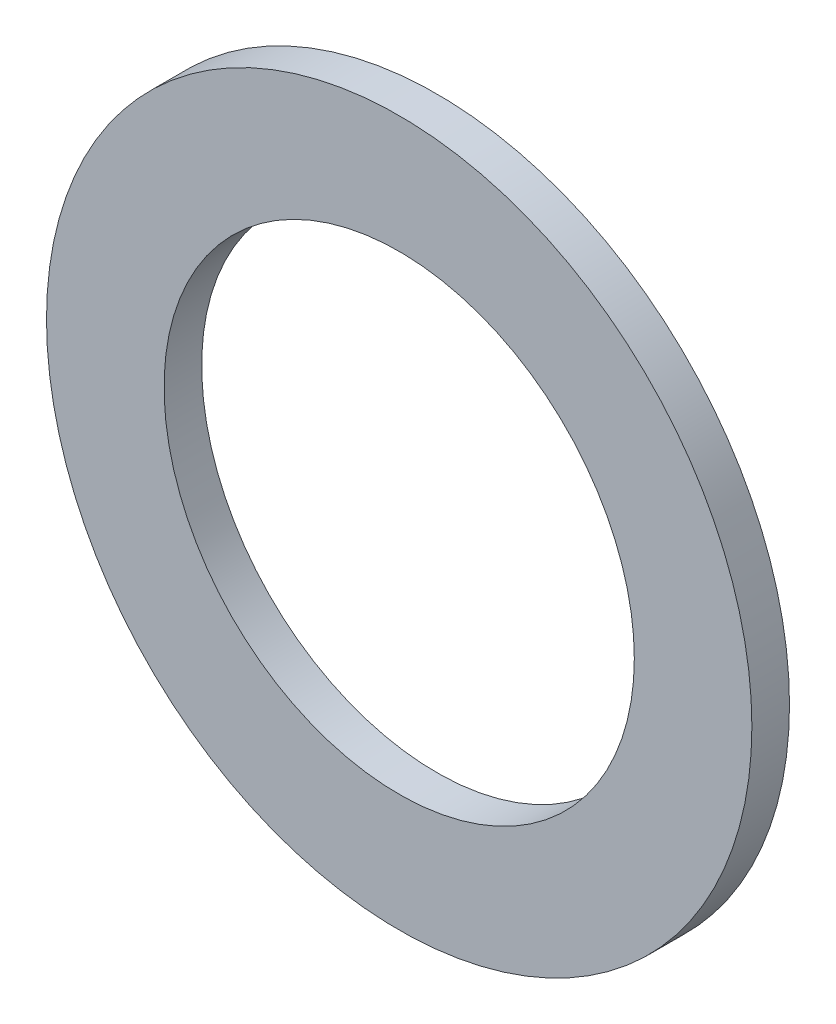
ISO-10303-21;
HEADER;
FILE_DESCRIPTION(('STEP AP214'),'2;1');
FILE_NAME('part.step','',(''),(''),'','','');
FILE_SCHEMA(('AUTOMOTIVE_DESIGN { 1 0 10303 214 1 1 1 1 }'));
ENDSEC;
DATA;
#1=APPLICATION_CONTEXT('core data for automotive mechanical design processes');
#2=APPLICATION_PROTOCOL_DEFINITION('international standard','automotive_design',2000,#1);
#3=PRODUCT_CONTEXT('',#1,'mechanical');
#4=PRODUCT('Part','Part','',(#3));
#5=PRODUCT_RELATED_PRODUCT_CATEGORY('part','',(#4));
#6=PRODUCT_DEFINITION_FORMATION('','',#4);
#7=PRODUCT_DEFINITION_CONTEXT('part definition',#1,'design');
#8=PRODUCT_DEFINITION('design','',#6,#7);
#9=PRODUCT_DEFINITION_SHAPE('','',#8);
#10=(LENGTH_UNIT() NAMED_UNIT(*) SI_UNIT(.MILLI.,.METRE.));
#11=(NAMED_UNIT(*) PLANE_ANGLE_UNIT() SI_UNIT($,.RADIAN.));
#12=(NAMED_UNIT(*) SI_UNIT($,.STERADIAN.) SOLID_ANGLE_UNIT());
#13=UNCERTAINTY_MEASURE_WITH_UNIT(LENGTH_MEASURE(1.E-05),#10,'distance_accuracy_value','');
#14=(GEOMETRIC_REPRESENTATION_CONTEXT(3) GLOBAL_UNCERTAINTY_ASSIGNED_CONTEXT((#13)) GLOBAL_UNIT_ASSIGNED_CONTEXT((#10,
#11,#12)) REPRESENTATION_CONTEXT('',''));
#15=CARTESIAN_POINT('',(0.,0.,0.));
#16=DIRECTION('',(0.,0.,1.));
#17=DIRECTION('',(1.,0.,0.));
#18=AXIS2_PLACEMENT_3D('',#15,#16,#17);
#19=CARTESIAN_POINT('',(0.,0.,0.127));
#20=DIRECTION('',(0.,0.,1.));
#21=DIRECTION('',(1.,0.,0.));
#22=AXIS2_PLACEMENT_3D('',#19,#20,#21);
#23=PLANE('',#22);
#24=CARTESIAN_POINT('',(0.,0.,0.127));
#25=DIRECTION('',(0.,0.,1.));
#26=DIRECTION('',(1.,0.,0.));
#27=AXIS2_PLACEMENT_3D('',#24,#25,#26);
#28=CIRCLE('',#27,2.38125);
#29=CARTESIAN_POINT('',(2.38125,0.,0.127));
#30=VERTEX_POINT('',#29);
#31=EDGE_CURVE('E10',#30,#30,#28,.T.);
#32=ORIENTED_EDGE('',*,*,#31,.T.);
#33=EDGE_LOOP('',(#32));
#34=FACE_BOUND('',#33,.T.);
#35=CARTESIAN_POINT('',(0.,0.,0.127));
#36=DIRECTION('',(0.,0.,1.));
#37=DIRECTION('',(1.,0.,0.));
#38=AXIS2_PLACEMENT_3D('',#35,#36,#37);
#39=CIRCLE('',#38,1.5875);
#40=CARTESIAN_POINT('',(1.5875,0.,0.127));
#41=VERTEX_POINT('',#40);
#42=EDGE_CURVE('E50',#41,#41,#39,.T.);
#43=ORIENTED_EDGE('',*,*,#42,.F.);
#44=EDGE_LOOP('',(#43));
#45=FACE_BOUND('',#44,.T.);
#46=ADVANCED_FACE('F37',(#34,#45),#23,.T.);
#47=CARTESIAN_POINT('',(0.,0.,-0.127));
#48=DIRECTION('',(0.,0.,1.));
#49=DIRECTION('',(1.,0.,0.));
#50=AXIS2_PLACEMENT_3D('',#47,#48,#49);
#51=PLANE('',#50);
#52=CARTESIAN_POINT('',(0.,0.,-0.127));
#53=DIRECTION('',(0.,0.,1.));
#54=DIRECTION('',(1.,0.,0.));
#55=AXIS2_PLACEMENT_3D('',#52,#53,#54);
#56=CIRCLE('',#55,2.38125);
#57=CARTESIAN_POINT('',(2.38125,0.,-0.127));
#58=VERTEX_POINT('',#57);
#59=EDGE_CURVE('E41',#58,#58,#56,.T.);
#60=ORIENTED_EDGE('',*,*,#59,.F.);
#61=EDGE_LOOP('',(#60));
#62=FACE_BOUND('',#61,.T.);
#63=CARTESIAN_POINT('',(0.,0.,-0.127));
#64=DIRECTION('',(0.,0.,1.));
#65=DIRECTION('',(1.,0.,0.));
#66=AXIS2_PLACEMENT_3D('',#63,#64,#65);
#67=CIRCLE('',#66,1.5875);
#68=CARTESIAN_POINT('',(1.5875,0.,-0.127));
#69=VERTEX_POINT('',#68);
#70=EDGE_CURVE('E52',#69,#69,#67,.T.);
#71=ORIENTED_EDGE('',*,*,#70,.T.);
#72=EDGE_LOOP('',(#71));
#73=FACE_BOUND('',#72,.T.);
#74=ADVANCED_FACE('F64',(#62,#73),#51,.F.);
#75=CARTESIAN_POINT('',(0.,0.,0.127));
#76=DIRECTION('',(0.,0.,-1.));
#77=DIRECTION('',(-1.,0.,0.));
#78=AXIS2_PLACEMENT_3D('',#75,#76,#77);
#79=CYLINDRICAL_SURFACE('',#78,2.38125);
#80=ORIENTED_EDGE('',*,*,#31,.F.);
#81=EDGE_LOOP('',(#80));
#82=FACE_BOUND('',#81,.T.);
#83=ORIENTED_EDGE('',*,*,#59,.T.);
#84=EDGE_LOOP('',(#83));
#85=FACE_BOUND('',#84,.T.);
#86=ADVANCED_FACE('F39',(#82,#85),#79,.T.);
#87=CARTESIAN_POINT('',(0.,0.,0.127));
#88=DIRECTION('',(0.,0.,-1.));
#89=DIRECTION('',(-1.,0.,0.));
#90=AXIS2_PLACEMENT_3D('',#87,#88,#89);
#91=CYLINDRICAL_SURFACE('',#90,1.5875);
#92=ORIENTED_EDGE('',*,*,#42,.T.);
#93=EDGE_LOOP('',(#92));
#94=FACE_BOUND('',#93,.T.);
#95=ORIENTED_EDGE('',*,*,#70,.F.);
#96=EDGE_LOOP('',(#95));
#97=FACE_BOUND('',#96,.T.);
#98=ADVANCED_FACE('F60',(#94,#97),#91,.F.);
#99=CLOSED_SHELL('',(#46,#74,#86,#98));
#100=MANIFOLD_SOLID_BREP('B2',#99);
#101=ADVANCED_BREP_SHAPE_REPRESENTATION('',(#18,#100),#14);
#102=SHAPE_DEFINITION_REPRESENTATION(#9,#101);
ENDSEC;
END-ISO-10303-21;
